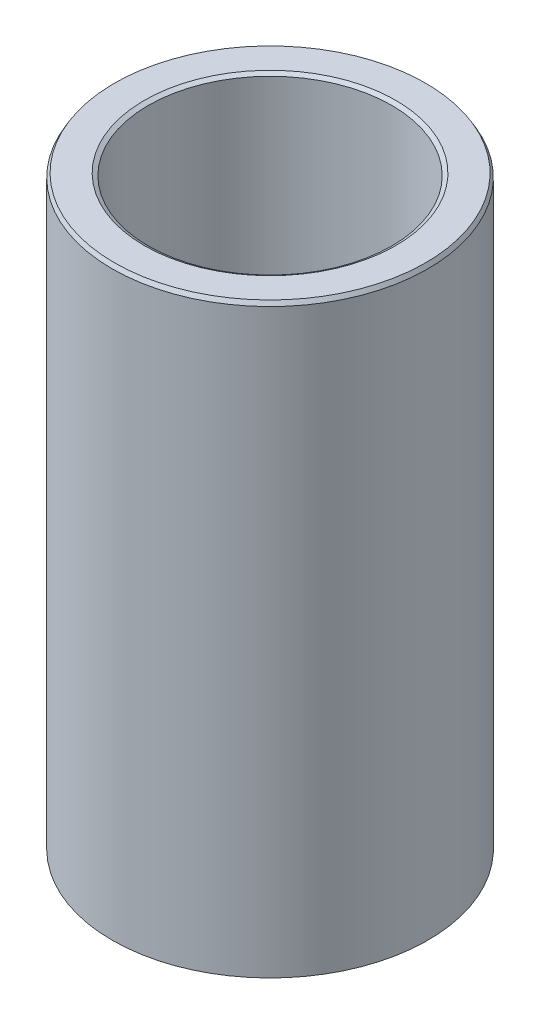
ISO-10303-21;
HEADER;
FILE_DESCRIPTION(('STEP AP214'),'2;1');
FILE_NAME('part.step','',(''),(''),'','','');
FILE_SCHEMA(('AUTOMOTIVE_DESIGN { 1 0 10303 214 1 1 1 1 }'));
ENDSEC;
DATA;
#1=APPLICATION_CONTEXT('core data for automotive mechanical design processes');
#2=APPLICATION_PROTOCOL_DEFINITION('international standard','automotive_design',2000,#1);
#3=PRODUCT_CONTEXT('',#1,'mechanical');
#4=PRODUCT('Part','Part','',(#3));
#5=PRODUCT_RELATED_PRODUCT_CATEGORY('part','',(#4));
#6=PRODUCT_DEFINITION_FORMATION('','',#4);
#7=PRODUCT_DEFINITION_CONTEXT('part definition',#1,'design');
#8=PRODUCT_DEFINITION('design','',#6,#7);
#9=PRODUCT_DEFINITION_SHAPE('','',#8);
#10=(LENGTH_UNIT() NAMED_UNIT(*) SI_UNIT(.MILLI.,.METRE.));
#11=(NAMED_UNIT(*) PLANE_ANGLE_UNIT() SI_UNIT($,.RADIAN.));
#12=(NAMED_UNIT(*) SI_UNIT($,.STERADIAN.) SOLID_ANGLE_UNIT());
#13=UNCERTAINTY_MEASURE_WITH_UNIT(LENGTH_MEASURE(1.E-05),#10,'distance_accuracy_value','');
#14=(GEOMETRIC_REPRESENTATION_CONTEXT(3) GLOBAL_UNCERTAINTY_ASSIGNED_CONTEXT((#13)) GLOBAL_UNIT_ASSIGNED_CONTEXT((#10,
#11,#12)) REPRESENTATION_CONTEXT('',''));
#15=CARTESIAN_POINT('',(0.,0.,0.));
#16=DIRECTION('',(0.,0.,1.));
#17=DIRECTION('',(1.,0.,0.));
#18=AXIS2_PLACEMENT_3D('',#15,#16,#17);
#19=CARTESIAN_POINT('',(0.,214.036817135424,0.));
#20=DIRECTION('',(0.,-1.,0.));
#21=DIRECTION('',(0.,0.,-1.));
#22=AXIS2_PLACEMENT_3D('',#19,#20,#21);
#23=CYLINDRICAL_SURFACE('',#22,57.5);
#24=CARTESIAN_POINT('',(0.,0.850154295379796,0.));
#25=DIRECTION('',(0.,1.,0.));
#26=DIRECTION('',(0.,0.,1.));
#27=AXIS2_PLACEMENT_3D('',#24,#25,#26);
#28=CIRCLE('',#27,57.5);
#29=CARTESIAN_POINT('',(0.,0.850154295379796,57.5));
#30=VERTEX_POINT('',#29);
#31=EDGE_CURVE('E10',#30,#30,#28,.T.);
#32=ORIENTED_EDGE('',*,*,#31,.T.);
#33=EDGE_LOOP('',(#32));
#34=FACE_BOUND('',#33,.T.);
#35=CARTESIAN_POINT('',(0.,212.564306701553,0.));
#36=DIRECTION('',(0.,1.,0.));
#37=DIRECTION('',(0.,0.,1.));
#38=AXIS2_PLACEMENT_3D('',#35,#36,#37);
#39=CIRCLE('',#38,57.5);
#40=CARTESIAN_POINT('',(0.,212.564306701553,57.5));
#41=VERTEX_POINT('',#40);
#42=EDGE_CURVE('E50',#41,#41,#39,.F.);
#43=ORIENTED_EDGE('',*,*,#42,.T.);
#44=EDGE_LOOP('',(#43));
#45=FACE_BOUND('',#44,.T.);
#46=ADVANCED_FACE('F39',(#34,#45),#23,.T.);
#47=CARTESIAN_POINT('',(0.,214.036817135424,0.));
#48=DIRECTION('',(0.,1.,0.));
#49=DIRECTION('',(0.,0.,1.));
#50=AXIS2_PLACEMENT_3D('',#47,#48,#49);
#51=PLANE('',#50);
#52=CARTESIAN_POINT('',(0.,214.036817135424,0.));
#53=DIRECTION('',(0.,1.,0.));
#54=DIRECTION('',(0.,0.,1.));
#55=AXIS2_PLACEMENT_3D('',#52,#53,#54);
#56=CIRCLE('',#55,45.8056144064069);
#57=CARTESIAN_POINT('',(0.,214.036817135424,45.8056144064069));
#58=VERTEX_POINT('',#57);
#59=EDGE_CURVE('E58',#58,#58,#56,.F.);
#60=ORIENTED_EDGE('',*,*,#59,.T.);
#61=EDGE_LOOP('',(#60));
#62=FACE_BOUND('',#61,.T.);
#63=CARTESIAN_POINT('',(0.,214.036817135424,0.));
#64=DIRECTION('',(0.,1.,0.));
#65=DIRECTION('',(0.,0.,1.));
#66=AXIS2_PLACEMENT_3D('',#63,#64,#65);
#67=CIRCLE('',#66,56.6498457046203);
#68=CARTESIAN_POINT('',(0.,214.036817135424,56.6498457046203));
#69=VERTEX_POINT('',#68);
#70=EDGE_CURVE('E61',#69,#69,#67,.T.);
#71=ORIENTED_EDGE('',*,*,#70,.T.);
#72=EDGE_LOOP('',(#71));
#73=FACE_BOUND('',#72,.T.);
#74=ADVANCED_FACE('F88',(#62,#73),#51,.T.);
#75=CARTESIAN_POINT('',(0.,0.,0.));
#76=DIRECTION('',(0.,1.,0.));
#77=DIRECTION('',(0.,0.,1.));
#78=AXIS2_PLACEMENT_3D('',#75,#76,#77);
#79=PLANE('',#78);
#80=CARTESIAN_POINT('',(0.,0.,0.));
#81=DIRECTION('',(0.,1.,0.));
#82=DIRECTION('',(0.,0.,1.));
#83=AXIS2_PLACEMENT_3D('',#80,#81,#82);
#84=CIRCLE('',#83,45.183258267916);
#85=CARTESIAN_POINT('',(0.,0.,45.183258267916));
#86=VERTEX_POINT('',#85);
#87=EDGE_CURVE('E51',#86,#86,#84,.T.);
#88=ORIENTED_EDGE('',*,*,#87,.T.);
#89=EDGE_LOOP('',(#88));
#90=FACE_BOUND('',#89,.T.);
#91=CARTESIAN_POINT('',(0.,0.,0.));
#92=DIRECTION('',(0.,1.,0.));
#93=DIRECTION('',(0.,0.,1.));
#94=AXIS2_PLACEMENT_3D('',#91,#92,#93);
#95=CIRCLE('',#94,56.0274895661293);
#96=CARTESIAN_POINT('',(0.,0.,56.0274895661293));
#97=VERTEX_POINT('',#96);
#98=EDGE_CURVE('E54',#97,#97,#95,.F.);
#99=ORIENTED_EDGE('',*,*,#98,.T.);
#100=EDGE_LOOP('',(#99));
#101=FACE_BOUND('',#100,.T.);
#102=ADVANCED_FACE('F83',(#90,#101),#79,.F.);
#103=CARTESIAN_POINT('',(0.,214.036817135424,0.));
#104=DIRECTION('',(0.,-1.,0.));
#105=DIRECTION('',(0.,0.,-1.));
#106=AXIS2_PLACEMENT_3D('',#103,#104,#105);
#107=CYLINDRICAL_SURFACE('',#106,44.3331039725363);
#108=CARTESIAN_POINT('',(0.,213.186662840044,0.));
#109=DIRECTION('',(0.,1.,0.));
#110=DIRECTION('',(0.,0.,1.));
#111=AXIS2_PLACEMENT_3D('',#108,#109,#110);
#112=CIRCLE('',#111,44.3331039725363);
#113=CARTESIAN_POINT('',(0.,213.186662840044,44.3331039725363));
#114=VERTEX_POINT('',#113);
#115=EDGE_CURVE('E67',#114,#114,#112,.T.);
#116=ORIENTED_EDGE('',*,*,#115,.T.);
#117=EDGE_LOOP('',(#116));
#118=FACE_BOUND('',#117,.T.);
#119=CARTESIAN_POINT('',(0.,1.47251043387067,0.));
#120=DIRECTION('',(0.,1.,0.));
#121=DIRECTION('',(0.,0.,1.));
#122=AXIS2_PLACEMENT_3D('',#119,#120,#121);
#123=CIRCLE('',#122,44.3331039725363);
#124=CARTESIAN_POINT('',(0.,1.47251043387067,44.3331039725363));
#125=VERTEX_POINT('',#124);
#126=EDGE_CURVE('E69',#125,#125,#123,.F.);
#127=ORIENTED_EDGE('',*,*,#126,.T.);
#128=EDGE_LOOP('',(#127));
#129=FACE_BOUND('',#128,.T.);
#130=ADVANCED_FACE('F71',(#118,#129),#107,.F.);
#131=CARTESIAN_POINT('',(0.,213.186662840044,0.));
#132=DIRECTION('',(0.,1.,0.));
#133=DIRECTION('',(0.,0.,1.));
#134=AXIS2_PLACEMENT_3D('',#131,#132,#133);
#135=CONICAL_SURFACE('',#134,44.3331039725363,1.04719755119658);
#136=ORIENTED_EDGE('',*,*,#59,.F.);
#137=EDGE_LOOP('',(#136));
#138=FACE_BOUND('',#137,.T.);
#139=ORIENTED_EDGE('',*,*,#115,.F.);
#140=EDGE_LOOP('',(#139));
#141=FACE_BOUND('',#140,.T.);
#142=ADVANCED_FACE('F77',(#138,#141),#135,.F.);
#143=CARTESIAN_POINT('',(0.,0.,0.));
#144=DIRECTION('',(0.,-1.,0.));
#145=DIRECTION('',(0.,0.,-1.));
#146=AXIS2_PLACEMENT_3D('',#143,#144,#145);
#147=CONICAL_SURFACE('',#146,45.183258267916,0.52359877559829);
#148=ORIENTED_EDGE('',*,*,#126,.F.);
#149=EDGE_LOOP('',(#148));
#150=FACE_BOUND('',#149,.T.);
#151=ORIENTED_EDGE('',*,*,#87,.F.);
#152=EDGE_LOOP('',(#151));
#153=FACE_BOUND('',#152,.T.);
#154=ADVANCED_FACE('F73',(#150,#153),#147,.F.);
#155=CARTESIAN_POINT('',(0.,0.850154295379796,0.));
#156=DIRECTION('',(0.,1.,0.));
#157=DIRECTION('',(0.,0.,1.));
#158=AXIS2_PLACEMENT_3D('',#155,#156,#157);
#159=CONICAL_SURFACE('',#158,57.5,1.0471975511966);
#160=ORIENTED_EDGE('',*,*,#98,.F.);
#161=EDGE_LOOP('',(#160));
#162=FACE_BOUND('',#161,.T.);
#163=ORIENTED_EDGE('',*,*,#31,.F.);
#164=EDGE_LOOP('',(#163));
#165=FACE_BOUND('',#164,.T.);
#166=ADVANCED_FACE('F76',(#162,#165),#159,.T.);
#167=CARTESIAN_POINT('',(0.,214.036817135424,0.));
#168=DIRECTION('',(0.,-1.,0.));
#169=DIRECTION('',(0.,0.,-1.));
#170=AXIS2_PLACEMENT_3D('',#167,#168,#169);
#171=CONICAL_SURFACE('',#170,56.6498457046203,0.523598775598292);
#172=ORIENTED_EDGE('',*,*,#42,.F.);
#173=EDGE_LOOP('',(#172));
#174=FACE_BOUND('',#173,.T.);
#175=ORIENTED_EDGE('',*,*,#70,.F.);
#176=EDGE_LOOP('',(#175));
#177=FACE_BOUND('',#176,.T.);
#178=ADVANCED_FACE('F45',(#174,#177),#171,.T.);
#179=CLOSED_SHELL('',(#46,#74,#102,#130,#142,#154,#166,#178));
#180=MANIFOLD_SOLID_BREP('B2',#179);
#181=ADVANCED_BREP_SHAPE_REPRESENTATION('',(#18,#180),#14);
#182=SHAPE_DEFINITION_REPRESENTATION(#9,#181);
ENDSEC;
END-ISO-10303-21;
